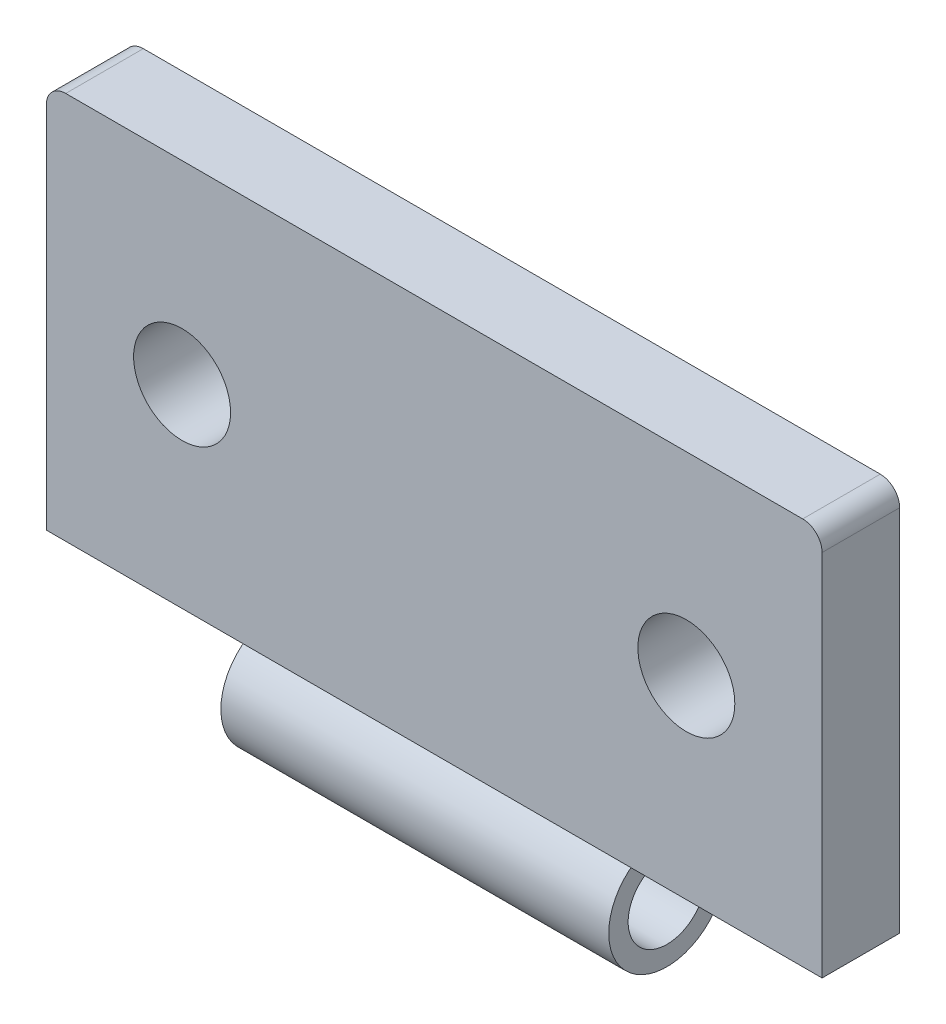
ISO-10303-21;
HEADER;
FILE_DESCRIPTION(('STEP AP214'),'2;1');
FILE_NAME('part.step','',(''),(''),'','','');
FILE_SCHEMA(('AUTOMOTIVE_DESIGN { 1 0 10303 214 1 1 1 1 }'));
ENDSEC;
DATA;
#1=APPLICATION_CONTEXT('core data for automotive mechanical design processes');
#2=APPLICATION_PROTOCOL_DEFINITION('international standard','automotive_design',2000,#1);
#3=PRODUCT_CONTEXT('',#1,'mechanical');
#4=PRODUCT('Part','Part','',(#3));
#5=PRODUCT_RELATED_PRODUCT_CATEGORY('part','',(#4));
#6=PRODUCT_DEFINITION_FORMATION('','',#4);
#7=PRODUCT_DEFINITION_CONTEXT('part definition',#1,'design');
#8=PRODUCT_DEFINITION('design','',#6,#7);
#9=PRODUCT_DEFINITION_SHAPE('','',#8);
#10=(LENGTH_UNIT() NAMED_UNIT(*) SI_UNIT(.MILLI.,.METRE.));
#11=(NAMED_UNIT(*) PLANE_ANGLE_UNIT() SI_UNIT($,.RADIAN.));
#12=(NAMED_UNIT(*) SI_UNIT($,.STERADIAN.) SOLID_ANGLE_UNIT());
#13=UNCERTAINTY_MEASURE_WITH_UNIT(LENGTH_MEASURE(1.E-05),#10,'distance_accuracy_value','');
#14=(GEOMETRIC_REPRESENTATION_CONTEXT(3) GLOBAL_UNCERTAINTY_ASSIGNED_CONTEXT((#13)) GLOBAL_UNIT_ASSIGNED_CONTEXT((#10,
#11,#12)) REPRESENTATION_CONTEXT('',''));
#15=CARTESIAN_POINT('',(0.,0.,0.));
#16=DIRECTION('',(0.,0.,1.));
#17=DIRECTION('',(1.,0.,0.));
#18=AXIS2_PLACEMENT_3D('',#15,#16,#17);
#19=CARTESIAN_POINT('',(-20.,-10.,2.));
#20=DIRECTION('',(0.,1.,0.));
#21=DIRECTION('',(0.,0.,1.));
#22=AXIS2_PLACEMENT_3D('',#19,#20,#21);
#23=PLANE('',#22);
#24=DIRECTION('',(1.,0.,0.));
#25=VECTOR('',#24,1.);
#26=CARTESIAN_POINT('',(-20.,-10.,-2.));
#27=LINE('',#26,#25);
#28=CARTESIAN_POINT('',(-20.,-10.,-2.));
#29=VERTEX_POINT('',#28);
#30=CARTESIAN_POINT('',(20.,-10.,-2.));
#31=VERTEX_POINT('',#30);
#32=EDGE_CURVE('E146',#29,#31,#27,.T.);
#33=ORIENTED_EDGE('',*,*,#32,.T.);
#34=DIRECTION('',(0.,0.,-1.));
#35=VECTOR('',#34,1.);
#36=CARTESIAN_POINT('',(20.,-10.,2.));
#37=LINE('',#36,#35);
#38=CARTESIAN_POINT('',(20.,-10.,2.));
#39=VERTEX_POINT('',#38);
#40=EDGE_CURVE('E152',#39,#31,#37,.T.);
#41=ORIENTED_EDGE('',*,*,#40,.F.);
#42=DIRECTION('',(1.,0.,0.));
#43=VECTOR('',#42,1.);
#44=CARTESIAN_POINT('',(-20.,-10.,2.));
#45=LINE('',#44,#43);
#46=CARTESIAN_POINT('',(-20.,-10.,2.));
#47=VERTEX_POINT('',#46);
#48=EDGE_CURVE('E150',#47,#39,#45,.T.);
#49=ORIENTED_EDGE('',*,*,#48,.F.);
#50=DIRECTION('',(0.,0.,-1.));
#51=VECTOR('',#50,1.);
#52=CARTESIAN_POINT('',(-20.,-10.,2.));
#53=LINE('',#52,#51);
#54=EDGE_CURVE('E119',#47,#29,#53,.T.);
#55=ORIENTED_EDGE('',*,*,#54,.T.);
#56=EDGE_LOOP('',(#33,#41,#49,#55));
#57=FACE_BOUND('',#56,.T.);
#58=DIRECTION('',(-1.,0.,0.));
#59=VECTOR('',#58,1.);
#60=CARTESIAN_POINT('',(10.,-10.,-1.6583123951777));
#61=LINE('',#60,#59);
#62=CARTESIAN_POINT('',(-10.,-10.,-1.6583123951777));
#63=VERTEX_POINT('',#62);
#64=CARTESIAN_POINT('',(10.,-10.,-1.6583123951777));
#65=VERTEX_POINT('',#64);
#66=EDGE_CURVE('E107',#63,#65,#61,.F.);
#67=ORIENTED_EDGE('',*,*,#66,.F.);
#68=DIRECTION('',(0.,0.,-1.));
#69=VECTOR('',#68,1.);
#70=CARTESIAN_POINT('',(-10.,-10.,2.));
#71=LINE('',#70,#69);
#72=CARTESIAN_POINT('',(-10.,-10.,1.6583123951777));
#73=VERTEX_POINT('',#72);
#74=EDGE_CURVE('E102',#73,#63,#71,.T.);
#75=ORIENTED_EDGE('',*,*,#74,.F.);
#76=DIRECTION('',(-1.,0.,0.));
#77=VECTOR('',#76,1.);
#78=CARTESIAN_POINT('',(10.,-10.,1.6583123951777));
#79=LINE('',#78,#77);
#80=CARTESIAN_POINT('',(10.,-10.,1.6583123951777));
#81=VERTEX_POINT('',#80);
#82=EDGE_CURVE('E104',#81,#73,#79,.T.);
#83=ORIENTED_EDGE('',*,*,#82,.F.);
#84=DIRECTION('',(0.,0.,-1.));
#85=VECTOR('',#84,1.);
#86=CARTESIAN_POINT('',(10.,-10.,2.));
#87=LINE('',#86,#85);
#88=EDGE_CURVE('E111',#81,#65,#87,.T.);
#89=ORIENTED_EDGE('',*,*,#88,.T.);
#90=EDGE_LOOP('',(#67,#75,#83,#89));
#91=FACE_BOUND('',#90,.T.);
#92=ADVANCED_FACE('F35',(#57,#91),#23,.F.);
#93=CARTESIAN_POINT('',(0.,0.,2.));
#94=DIRECTION('',(0.,0.,1.));
#95=DIRECTION('',(1.,0.,0.));
#96=AXIS2_PLACEMENT_3D('',#93,#94,#95);
#97=PLANE('',#96);
#98=CARTESIAN_POINT('',(-13.,0.,2.));
#99=DIRECTION('',(0.,0.,1.));
#100=DIRECTION('',(1.,0.,0.));
#101=AXIS2_PLACEMENT_3D('',#98,#99,#100);
#102=CIRCLE('',#101,2.5);
#103=CARTESIAN_POINT('',(-10.5,0.,2.));
#104=VERTEX_POINT('',#103);
#105=EDGE_CURVE('E137',#104,#104,#102,.T.);
#106=ORIENTED_EDGE('',*,*,#105,.F.);
#107=EDGE_LOOP('',(#106));
#108=FACE_BOUND('',#107,.T.);
#109=DIRECTION('',(0.,1.,0.));
#110=VECTOR('',#109,1.);
#111=CARTESIAN_POINT('',(20.,10.,2.));
#112=LINE('',#111,#110);
#113=CARTESIAN_POINT('',(20.,9.00000000000001,2.));
#114=VERTEX_POINT('',#113);
#115=EDGE_CURVE('E143',#39,#114,#112,.T.);
#116=ORIENTED_EDGE('',*,*,#115,.T.);
#117=CARTESIAN_POINT('',(19.,9.00000000000001,2.));
#118=DIRECTION('',(0.,0.,1.));
#119=DIRECTION('',(1.,0.,0.));
#120=AXIS2_PLACEMENT_3D('',#117,#118,#119);
#121=CIRCLE('',#120,1.);
#122=CARTESIAN_POINT('',(19.,10.,2.));
#123=VERTEX_POINT('',#122);
#124=EDGE_CURVE('E43',#114,#123,#121,.T.);
#125=ORIENTED_EDGE('',*,*,#124,.T.);
#126=DIRECTION('',(-1.,0.,0.));
#127=VECTOR('',#126,1.);
#128=CARTESIAN_POINT('',(-20.,10.,2.));
#129=LINE('',#128,#127);
#130=CARTESIAN_POINT('',(-19.,10.,2.));
#131=VERTEX_POINT('',#130);
#132=EDGE_CURVE('E145',#123,#131,#129,.T.);
#133=ORIENTED_EDGE('',*,*,#132,.T.);
#134=CARTESIAN_POINT('',(-19.,9.00000000000001,2.));
#135=DIRECTION('',(0.,0.,1.));
#136=DIRECTION('',(1.,0.,0.));
#137=AXIS2_PLACEMENT_3D('',#134,#135,#136);
#138=CIRCLE('',#137,1.);
#139=CARTESIAN_POINT('',(-20.,9.00000000000001,2.));
#140=VERTEX_POINT('',#139);
#141=EDGE_CURVE('E50',#131,#140,#138,.T.);
#142=ORIENTED_EDGE('',*,*,#141,.T.);
#143=DIRECTION('',(0.,-1.,0.));
#144=VECTOR('',#143,1.);
#145=CARTESIAN_POINT('',(-20.,10.,2.));
#146=LINE('',#145,#144);
#147=EDGE_CURVE('E148',#140,#47,#146,.T.);
#148=ORIENTED_EDGE('',*,*,#147,.T.);
#149=ORIENTED_EDGE('',*,*,#48,.T.);
#150=EDGE_LOOP('',(#116,#125,#133,#142,#148,#149));
#151=FACE_BOUND('',#150,.T.);
#152=CARTESIAN_POINT('',(13.,0.,2.));
#153=DIRECTION('',(0.,0.,1.));
#154=DIRECTION('',(1.,0.,0.));
#155=AXIS2_PLACEMENT_3D('',#152,#153,#154);
#156=CIRCLE('',#155,2.5);
#157=CARTESIAN_POINT('',(15.5,0.,2.));
#158=VERTEX_POINT('',#157);
#159=EDGE_CURVE('E131',#158,#158,#156,.T.);
#160=ORIENTED_EDGE('',*,*,#159,.F.);
#161=EDGE_LOOP('',(#160));
#162=FACE_BOUND('',#161,.T.);
#163=ADVANCED_FACE('F178',(#108,#151,#162),#97,.T.);
#164=CARTESIAN_POINT('',(0.,0.,-2.));
#165=DIRECTION('',(0.,0.,1.));
#166=DIRECTION('',(1.,0.,0.));
#167=AXIS2_PLACEMENT_3D('',#164,#165,#166);
#168=PLANE('',#167);
#169=DIRECTION('',(-1.,0.,0.));
#170=VECTOR('',#169,1.);
#171=CARTESIAN_POINT('',(-20.,10.,-2.));
#172=LINE('',#171,#170);
#173=CARTESIAN_POINT('',(19.,10.,-2.));
#174=VERTEX_POINT('',#173);
#175=CARTESIAN_POINT('',(-19.,10.,-2.));
#176=VERTEX_POINT('',#175);
#177=EDGE_CURVE('E154',#174,#176,#172,.T.);
#178=ORIENTED_EDGE('',*,*,#177,.F.);
#179=CARTESIAN_POINT('',(19.,9.00000000000001,-2.));
#180=DIRECTION('',(0.,0.,1.));
#181=DIRECTION('',(1.,0.,0.));
#182=AXIS2_PLACEMENT_3D('',#179,#180,#181);
#183=CIRCLE('',#182,1.);
#184=CARTESIAN_POINT('',(20.,9.00000000000001,-2.));
#185=VERTEX_POINT('',#184);
#186=EDGE_CURVE('E173',#174,#185,#183,.F.);
#187=ORIENTED_EDGE('',*,*,#186,.T.);
#188=DIRECTION('',(0.,1.,0.));
#189=VECTOR('',#188,1.);
#190=CARTESIAN_POINT('',(20.,10.,-2.));
#191=LINE('',#190,#189);
#192=EDGE_CURVE('E140',#31,#185,#191,.T.);
#193=ORIENTED_EDGE('',*,*,#192,.F.);
#194=ORIENTED_EDGE('',*,*,#32,.F.);
#195=DIRECTION('',(0.,-1.,0.));
#196=VECTOR('',#195,1.);
#197=CARTESIAN_POINT('',(-20.,10.,-2.));
#198=LINE('',#197,#196);
#199=CARTESIAN_POINT('',(-20.,9.00000000000001,-2.));
#200=VERTEX_POINT('',#199);
#201=EDGE_CURVE('E157',#200,#29,#198,.T.);
#202=ORIENTED_EDGE('',*,*,#201,.F.);
#203=CARTESIAN_POINT('',(-19.,9.00000000000001,-2.));
#204=DIRECTION('',(0.,0.,1.));
#205=DIRECTION('',(1.,0.,0.));
#206=AXIS2_PLACEMENT_3D('',#203,#204,#205);
#207=CIRCLE('',#206,1.);
#208=EDGE_CURVE('E171',#200,#176,#207,.F.);
#209=ORIENTED_EDGE('',*,*,#208,.T.);
#210=EDGE_LOOP('',(#178,#187,#193,#194,#202,#209));
#211=FACE_BOUND('',#210,.T.);
#212=CARTESIAN_POINT('',(-13.,0.,-2.));
#213=DIRECTION('',(0.,0.,1.));
#214=DIRECTION('',(1.,0.,0.));
#215=AXIS2_PLACEMENT_3D('',#212,#213,#214);
#216=CIRCLE('',#215,2.5);
#217=CARTESIAN_POINT('',(-10.5,0.,-2.));
#218=VERTEX_POINT('',#217);
#219=EDGE_CURVE('E134',#218,#218,#216,.T.);
#220=ORIENTED_EDGE('',*,*,#219,.T.);
#221=EDGE_LOOP('',(#220));
#222=FACE_BOUND('',#221,.T.);
#223=CARTESIAN_POINT('',(13.,0.,-2.));
#224=DIRECTION('',(0.,0.,1.));
#225=DIRECTION('',(1.,0.,0.));
#226=AXIS2_PLACEMENT_3D('',#223,#224,#225);
#227=CIRCLE('',#226,2.5);
#228=CARTESIAN_POINT('',(15.5,0.,-2.));
#229=VERTEX_POINT('',#228);
#230=EDGE_CURVE('E124',#229,#229,#227,.T.);
#231=ORIENTED_EDGE('',*,*,#230,.T.);
#232=EDGE_LOOP('',(#231));
#233=FACE_BOUND('',#232,.T.);
#234=ADVANCED_FACE('F189',(#211,#222,#233),#168,.F.);
#235=CARTESIAN_POINT('',(20.,10.,2.));
#236=DIRECTION('',(-1.,0.,0.));
#237=DIRECTION('',(0.,-1.,0.));
#238=AXIS2_PLACEMENT_3D('',#235,#236,#237);
#239=PLANE('',#238);
#240=ORIENTED_EDGE('',*,*,#192,.T.);
#241=DIRECTION('',(0.,0.,-1.));
#242=VECTOR('',#241,1.);
#243=CARTESIAN_POINT('',(20.,9.00000000000001,2.));
#244=LINE('',#243,#242);
#245=EDGE_CURVE('E58',#185,#114,#244,.F.);
#246=ORIENTED_EDGE('',*,*,#245,.T.);
#247=ORIENTED_EDGE('',*,*,#115,.F.);
#248=ORIENTED_EDGE('',*,*,#40,.T.);
#249=EDGE_LOOP('',(#240,#246,#247,#248));
#250=FACE_BOUND('',#249,.T.);
#251=ADVANCED_FACE('F192',(#250),#239,.F.);
#252=CARTESIAN_POINT('',(-20.,10.,2.));
#253=DIRECTION('',(0.,-1.,0.));
#254=DIRECTION('',(0.,0.,-1.));
#255=AXIS2_PLACEMENT_3D('',#252,#253,#254);
#256=PLANE('',#255);
#257=ORIENTED_EDGE('',*,*,#132,.F.);
#258=DIRECTION('',(0.,0.,-1.));
#259=VECTOR('',#258,1.);
#260=CARTESIAN_POINT('',(19.,10.,2.));
#261=LINE('',#260,#259);
#262=EDGE_CURVE('E168',#123,#174,#261,.T.);
#263=ORIENTED_EDGE('',*,*,#262,.T.);
#264=ORIENTED_EDGE('',*,*,#177,.T.);
#265=DIRECTION('',(0.,0.,-1.));
#266=VECTOR('',#265,1.);
#267=CARTESIAN_POINT('',(-19.,10.,2.));
#268=LINE('',#267,#266);
#269=EDGE_CURVE('E166',#176,#131,#268,.F.);
#270=ORIENTED_EDGE('',*,*,#269,.T.);
#271=EDGE_LOOP('',(#257,#263,#264,#270));
#272=FACE_BOUND('',#271,.T.);
#273=ADVANCED_FACE('F183',(#272),#256,.F.);
#274=CARTESIAN_POINT('',(-20.,10.,2.));
#275=DIRECTION('',(1.,0.,0.));
#276=DIRECTION('',(0.,1.,0.));
#277=AXIS2_PLACEMENT_3D('',#274,#275,#276);
#278=PLANE('',#277);
#279=ORIENTED_EDGE('',*,*,#147,.F.);
#280=DIRECTION('',(0.,0.,-1.));
#281=VECTOR('',#280,1.);
#282=CARTESIAN_POINT('',(-20.,9.00000000000001,2.));
#283=LINE('',#282,#281);
#284=EDGE_CURVE('E11',#140,#200,#283,.T.);
#285=ORIENTED_EDGE('',*,*,#284,.T.);
#286=ORIENTED_EDGE('',*,*,#201,.T.);
#287=ORIENTED_EDGE('',*,*,#54,.F.);
#288=EDGE_LOOP('',(#279,#285,#286,#287));
#289=FACE_BOUND('',#288,.T.);
#290=ADVANCED_FACE('F199',(#289),#278,.F.);
#291=CARTESIAN_POINT('',(-13.,0.,2.));
#292=DIRECTION('',(0.,0.,-1.));
#293=DIRECTION('',(-1.,0.,0.));
#294=AXIS2_PLACEMENT_3D('',#291,#292,#293);
#295=CYLINDRICAL_SURFACE('',#294,2.5);
#296=ORIENTED_EDGE('',*,*,#105,.T.);
#297=EDGE_LOOP('',(#296));
#298=FACE_BOUND('',#297,.T.);
#299=ORIENTED_EDGE('',*,*,#219,.F.);
#300=EDGE_LOOP('',(#299));
#301=FACE_BOUND('',#300,.T.);
#302=ADVANCED_FACE('F218',(#298,#301),#295,.F.);
#303=CARTESIAN_POINT('',(13.,0.,2.));
#304=DIRECTION('',(0.,0.,-1.));
#305=DIRECTION('',(-1.,0.,0.));
#306=AXIS2_PLACEMENT_3D('',#303,#304,#305);
#307=CYLINDRICAL_SURFACE('',#306,2.5);
#308=ORIENTED_EDGE('',*,*,#159,.T.);
#309=EDGE_LOOP('',(#308));
#310=FACE_BOUND('',#309,.T.);
#311=ORIENTED_EDGE('',*,*,#230,.F.);
#312=EDGE_LOOP('',(#311));
#313=FACE_BOUND('',#312,.T.);
#314=ADVANCED_FACE('F267',(#310,#313),#307,.F.);
#315=CARTESIAN_POINT('',(10.,-12.5,0.));
#316=DIRECTION('',(1.,0.,0.));
#317=DIRECTION('',(0.,0.,-1.));
#318=AXIS2_PLACEMENT_3D('',#315,#316,#317);
#319=PLANE('',#318);
#320=CARTESIAN_POINT('',(10.,-12.5,0.));
#321=DIRECTION('',(1.,0.,0.));
#322=DIRECTION('',(0.,0.,-1.));
#323=AXIS2_PLACEMENT_3D('',#320,#321,#322);
#324=CIRCLE('',#323,2.);
#325=CARTESIAN_POINT('',(10.,-12.5,-2.));
#326=VERTEX_POINT('',#325);
#327=EDGE_CURVE('E122',#326,#326,#324,.T.);
#328=ORIENTED_EDGE('',*,*,#327,.F.);
#329=EDGE_LOOP('',(#328));
#330=FACE_BOUND('',#329,.T.);
#331=ORIENTED_EDGE('',*,*,#88,.F.);
#332=CARTESIAN_POINT('',(10.,-12.5,0.));
#333=DIRECTION('',(1.,0.,0.));
#334=DIRECTION('',(0.,0.,-1.));
#335=AXIS2_PLACEMENT_3D('',#332,#333,#334);
#336=CIRCLE('',#335,3.);
#337=EDGE_CURVE('E118',#81,#65,#336,.T.);
#338=ORIENTED_EDGE('',*,*,#337,.T.);
#339=EDGE_LOOP('',(#331,#338));
#340=FACE_BOUND('',#339,.T.);
#341=ADVANCED_FACE('F258',(#330,#340),#319,.T.);
#342=CARTESIAN_POINT('',(-10.,-12.5,0.));
#343=DIRECTION('',(1.,0.,0.));
#344=DIRECTION('',(0.,0.,-1.));
#345=AXIS2_PLACEMENT_3D('',#342,#343,#344);
#346=PLANE('',#345);
#347=CARTESIAN_POINT('',(-10.,-12.5,0.));
#348=DIRECTION('',(1.,0.,0.));
#349=DIRECTION('',(0.,0.,-1.));
#350=AXIS2_PLACEMENT_3D('',#347,#348,#349);
#351=CIRCLE('',#350,2.);
#352=CARTESIAN_POINT('',(-10.,-12.5,-2.));
#353=VERTEX_POINT('',#352);
#354=EDGE_CURVE('E127',#353,#353,#351,.T.);
#355=ORIENTED_EDGE('',*,*,#354,.T.);
#356=EDGE_LOOP('',(#355));
#357=FACE_BOUND('',#356,.T.);
#358=CARTESIAN_POINT('',(-10.,-12.5,0.));
#359=DIRECTION('',(1.,0.,0.));
#360=DIRECTION('',(0.,0.,-1.));
#361=AXIS2_PLACEMENT_3D('',#358,#359,#360);
#362=CIRCLE('',#361,3.);
#363=EDGE_CURVE('E116',#73,#63,#362,.T.);
#364=ORIENTED_EDGE('',*,*,#363,.F.);
#365=ORIENTED_EDGE('',*,*,#74,.T.);
#366=EDGE_LOOP('',(#364,#365));
#367=FACE_BOUND('',#366,.T.);
#368=ADVANCED_FACE('F121',(#357,#367),#346,.F.);
#369=CARTESIAN_POINT('',(10.,-12.5,0.));
#370=DIRECTION('',(-1.,0.,0.));
#371=DIRECTION('',(0.,0.,1.));
#372=AXIS2_PLACEMENT_3D('',#369,#370,#371);
#373=CYLINDRICAL_SURFACE('',#372,3.);
#374=ORIENTED_EDGE('',*,*,#363,.T.);
#375=ORIENTED_EDGE('',*,*,#66,.T.);
#376=ORIENTED_EDGE('',*,*,#337,.F.);
#377=ORIENTED_EDGE('',*,*,#82,.T.);
#378=EDGE_LOOP('',(#374,#375,#376,#377));
#379=FACE_BOUND('',#378,.T.);
#380=ADVANCED_FACE('F115',(#379),#373,.T.);
#381=CARTESIAN_POINT('',(10.,-12.5,0.));
#382=DIRECTION('',(-1.,0.,0.));
#383=DIRECTION('',(0.,0.,1.));
#384=AXIS2_PLACEMENT_3D('',#381,#382,#383);
#385=CYLINDRICAL_SURFACE('',#384,2.);
#386=ORIENTED_EDGE('',*,*,#327,.T.);
#387=EDGE_LOOP('',(#386));
#388=FACE_BOUND('',#387,.T.);
#389=ORIENTED_EDGE('',*,*,#354,.F.);
#390=EDGE_LOOP('',(#389));
#391=FACE_BOUND('',#390,.T.);
#392=ADVANCED_FACE('F206',(#388,#391),#385,.F.);
#393=CARTESIAN_POINT('',(19.,9.00000000000001,2.));
#394=DIRECTION('',(0.,0.,-1.));
#395=DIRECTION('',(-1.,0.,0.));
#396=AXIS2_PLACEMENT_3D('',#393,#394,#395);
#397=CYLINDRICAL_SURFACE('',#396,1.);
#398=ORIENTED_EDGE('',*,*,#124,.F.);
#399=ORIENTED_EDGE('',*,*,#245,.F.);
#400=ORIENTED_EDGE('',*,*,#186,.F.);
#401=ORIENTED_EDGE('',*,*,#262,.F.);
#402=EDGE_LOOP('',(#398,#399,#400,#401));
#403=FACE_BOUND('',#402,.T.);
#404=ADVANCED_FACE('F186',(#403),#397,.T.);
#405=CARTESIAN_POINT('',(-19.,9.00000000000001,2.));
#406=DIRECTION('',(0.,0.,-1.));
#407=DIRECTION('',(-1.,0.,0.));
#408=AXIS2_PLACEMENT_3D('',#405,#406,#407);
#409=CYLINDRICAL_SURFACE('',#408,1.);
#410=ORIENTED_EDGE('',*,*,#141,.F.);
#411=ORIENTED_EDGE('',*,*,#269,.F.);
#412=ORIENTED_EDGE('',*,*,#208,.F.);
#413=ORIENTED_EDGE('',*,*,#284,.F.);
#414=EDGE_LOOP('',(#410,#411,#412,#413));
#415=FACE_BOUND('',#414,.T.);
#416=ADVANCED_FACE('F37',(#415),#409,.T.);
#417=CLOSED_SHELL('',(#92,#163,#234,#251,#273,#290,#302,#314,#341,#368,#380,#392,#404,#416));
#418=MANIFOLD_SOLID_BREP('B2',#417);
#419=ADVANCED_BREP_SHAPE_REPRESENTATION('',(#18,#418),#14);
#420=SHAPE_DEFINITION_REPRESENTATION(#9,#419);
ENDSEC;
END-ISO-10303-21;
